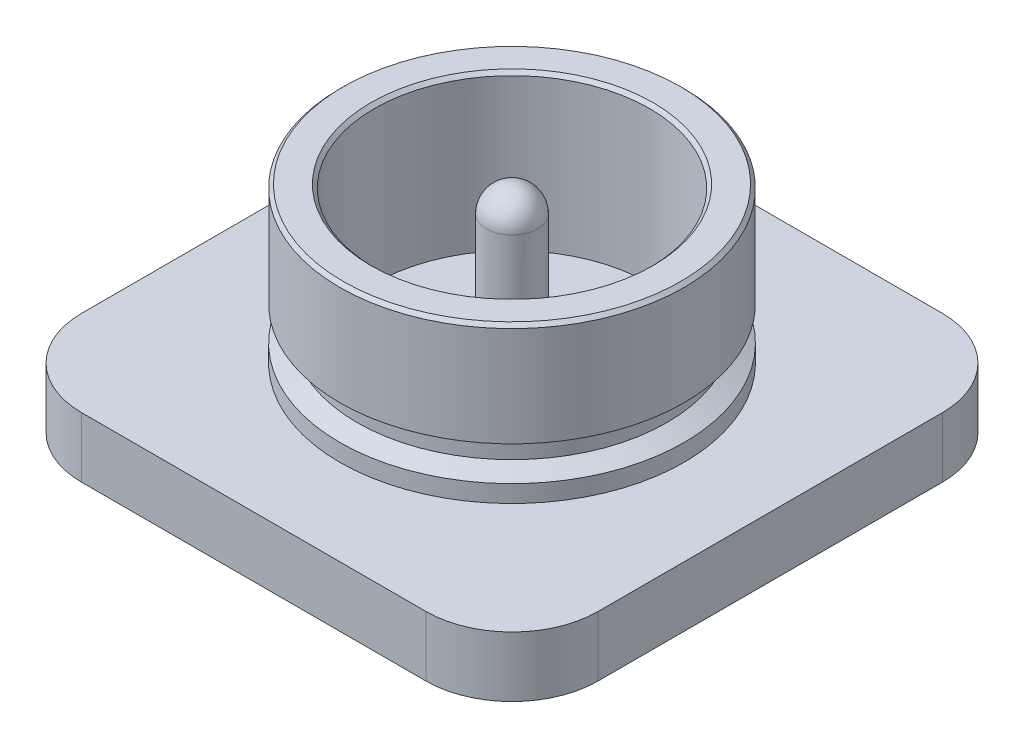
ISO-10303-21;
HEADER;
FILE_DESCRIPTION(('STEP AP214'),'2;1');
FILE_NAME('part.step','',(''),(''),'','','');
FILE_SCHEMA(('AUTOMOTIVE_DESIGN { 1 0 10303 214 1 1 1 1 }'));
ENDSEC;
DATA;
#1=APPLICATION_CONTEXT('core data for automotive mechanical design processes');
#2=APPLICATION_PROTOCOL_DEFINITION('international standard','automotive_design',2000,#1);
#3=PRODUCT_CONTEXT('',#1,'mechanical');
#4=PRODUCT('Part','Part','',(#3));
#5=PRODUCT_RELATED_PRODUCT_CATEGORY('part','',(#4));
#6=PRODUCT_DEFINITION_FORMATION('','',#4);
#7=PRODUCT_DEFINITION_CONTEXT('part definition',#1,'design');
#8=PRODUCT_DEFINITION('design','',#6,#7);
#9=PRODUCT_DEFINITION_SHAPE('','',#8);
#10=(LENGTH_UNIT() NAMED_UNIT(*) SI_UNIT(.MILLI.,.METRE.));
#11=(NAMED_UNIT(*) PLANE_ANGLE_UNIT() SI_UNIT($,.RADIAN.));
#12=(NAMED_UNIT(*) SI_UNIT($,.STERADIAN.) SOLID_ANGLE_UNIT());
#13=UNCERTAINTY_MEASURE_WITH_UNIT(LENGTH_MEASURE(1.E-05),#10,'distance_accuracy_value','');
#14=(GEOMETRIC_REPRESENTATION_CONTEXT(3) GLOBAL_UNCERTAINTY_ASSIGNED_CONTEXT((#13)) GLOBAL_UNIT_ASSIGNED_CONTEXT((#10,
#11,#12)) REPRESENTATION_CONTEXT('',''));
#15=CARTESIAN_POINT('',(0.,0.,0.));
#16=DIRECTION('',(0.,0.,1.));
#17=DIRECTION('',(1.,0.,0.));
#18=AXIS2_PLACEMENT_3D('',#15,#16,#17);
#19=CARTESIAN_POINT('',(-8.95484467631839,4.93275388580445,0.));
#20=DIRECTION('',(1.,0.,0.));
#21=DIRECTION('',(0.,1.,0.));
#22=AXIS2_PLACEMENT_3D('',#19,#20,#21);
#23=SPHERICAL_SURFACE('',#22,0.15);
#24=CARTESIAN_POINT('',(-8.95484467631839,4.93275388580445,0.));
#25=DIRECTION('',(0.,-1.,0.));
#26=DIRECTION('',(0.,0.,-1.));
#27=AXIS2_PLACEMENT_3D('',#24,#25,#26);
#28=CIRCLE('',#27,0.15);
#29=CARTESIAN_POINT('',(-9.10484467631839,4.93275388580445,0.));
#30=VERTEX_POINT('',#29);
#31=CARTESIAN_POINT('',(-8.80484467631839,4.93275388580445,0.));
#32=VERTEX_POINT('',#31);
#33=EDGE_CURVE('E21',#30,#32,#28,.T.);
#34=ORIENTED_EDGE('',*,*,#33,.F.);
#35=CARTESIAN_POINT('',(-8.95484467631839,4.93275388580445,0.));
#36=DIRECTION('',(0.,-1.,0.));
#37=DIRECTION('',(0.,0.,-1.));
#38=AXIS2_PLACEMENT_3D('',#35,#36,#37);
#39=CIRCLE('',#38,0.15);
#40=EDGE_CURVE('E33',#32,#30,#39,.T.);
#41=ORIENTED_EDGE('',*,*,#40,.F.);
#42=EDGE_LOOP('',(#34,#41));
#43=FACE_BOUND('',#42,.T.);
#44=ADVANCED_FACE('F17',(#43),#23,.T.);
#45=CARTESIAN_POINT('',(-8.95484467631839,5.08275388580445,0.));
#46=DIRECTION('',(0.,-1.,0.));
#47=DIRECTION('',(0.,0.,-1.));
#48=AXIS2_PLACEMENT_3D('',#45,#46,#47);
#49=CYLINDRICAL_SURFACE('',#48,0.15);
#50=ORIENTED_EDGE('',*,*,#33,.T.);
#51=ORIENTED_EDGE('',*,*,#40,.T.);
#52=EDGE_LOOP('',(#50,#51));
#53=FACE_BOUND('',#52,.T.);
#54=CARTESIAN_POINT('',(-8.95484467631839,4.18275388580445,0.));
#55=DIRECTION('',(0.,-1.,0.));
#56=DIRECTION('',(0.,0.,-1.));
#57=AXIS2_PLACEMENT_3D('',#54,#55,#56);
#58=CIRCLE('',#57,0.15);
#59=CARTESIAN_POINT('',(-8.95484467631839,4.18275388580445,-0.15));
#60=VERTEX_POINT('',#59);
#61=EDGE_CURVE('E196',#60,#60,#58,.T.);
#62=ORIENTED_EDGE('',*,*,#61,.F.);
#63=EDGE_LOOP('',(#62));
#64=FACE_BOUND('',#63,.T.);
#65=ADVANCED_FACE('F200',(#53,#64),#49,.T.);
#66=CARTESIAN_POINT('',(-9.14234467631839,4.18275388580445,0.1875));
#67=DIRECTION('',(0.,1.,0.));
#68=DIRECTION('',(-1.,0.,0.));
#69=AXIS2_PLACEMENT_3D('',#66,#67,#68);
#70=PLANE('',#69);
#71=CARTESIAN_POINT('',(-8.95484467631839,4.18275388580445,0.));
#72=DIRECTION('',(0.,-1.,0.));
#73=DIRECTION('',(0.,0.,-1.));
#74=AXIS2_PLACEMENT_3D('',#71,#72,#73);
#75=CIRCLE('',#74,0.8);
#76=CARTESIAN_POINT('',(-8.95484467631839,4.18275388580445,-0.8));
#77=VERTEX_POINT('',#76);
#78=EDGE_CURVE('E176',#77,#77,#75,.F.);
#79=ORIENTED_EDGE('',*,*,#78,.T.);
#80=EDGE_LOOP('',(#79));
#81=FACE_BOUND('',#80,.T.);
#82=ORIENTED_EDGE('',*,*,#61,.T.);
#83=EDGE_LOOP('',(#82));
#84=FACE_BOUND('',#83,.T.);
#85=ADVANCED_FACE('F209',(#81,#84),#70,.T.);
#86=CARTESIAN_POINT('',(-8.95484467631839,5.08275388580445,0.));
#87=DIRECTION('',(0.,-1.,0.));
#88=DIRECTION('',(0.,0.,-1.));
#89=AXIS2_PLACEMENT_3D('',#86,#87,#88);
#90=CYLINDRICAL_SURFACE('',#89,0.8);
#91=CARTESIAN_POINT('',(-8.95484467631839,5.06275388579525,0.));
#92=DIRECTION('',(0.,1.,0.));
#93=DIRECTION('',(-1.,0.,0.));
#94=AXIS2_PLACEMENT_3D('',#91,#92,#93);
#95=CIRCLE('',#94,0.79999999993326);
#96=CARTESIAN_POINT('',(-9.75484467625165,5.06275388579525,0.));
#97=VERTEX_POINT('',#96);
#98=EDGE_CURVE('E172',#97,#97,#95,.T.);
#99=ORIENTED_EDGE('',*,*,#98,.T.);
#100=EDGE_LOOP('',(#99));
#101=FACE_BOUND('',#100,.T.);
#102=ORIENTED_EDGE('',*,*,#78,.F.);
#103=EDGE_LOOP('',(#102));
#104=FACE_BOUND('',#103,.T.);
#105=ADVANCED_FACE('F279',(#101,#104),#90,.F.);
#106=CARTESIAN_POINT('',(-8.95484467631839,5.08275388580159,0.));
#107=DIRECTION('',(0.,1.,0.));
#108=DIRECTION('',(0.,0.,1.));
#109=AXIS2_PLACEMENT_3D('',#106,#107,#108);
#110=CONICAL_SURFACE('',#109,0.819999999939609,0.785398163397448);
#111=CARTESIAN_POINT('',(-8.95484467631839,5.08275388585844,0.));
#112=DIRECTION('',(0.,1.,0.));
#113=DIRECTION('',(0.,0.,1.));
#114=AXIS2_PLACEMENT_3D('',#111,#112,#113);
#115=CIRCLE('',#114,0.819999999996452);
#116=CARTESIAN_POINT('',(-8.95484467631839,5.08275388585844,0.819999999996452));
#117=VERTEX_POINT('',#116);
#118=EDGE_CURVE('E175',#117,#117,#115,.F.);
#119=ORIENTED_EDGE('',*,*,#118,.F.);
#120=EDGE_LOOP('',(#119));
#121=FACE_BOUND('',#120,.T.);
#122=ORIENTED_EDGE('',*,*,#98,.F.);
#123=EDGE_LOOP('',(#122));
#124=FACE_BOUND('',#123,.T.);
#125=ADVANCED_FACE('F275',(#121,#124),#110,.F.);
#126=CARTESIAN_POINT('',(-9.45484467631839,5.08275388580445,0.));
#127=DIRECTION('',(0.,1.,0.));
#128=DIRECTION('',(0.,0.,1.));
#129=AXIS2_PLACEMENT_3D('',#126,#127,#128);
#130=PLANE('',#129);
#131=ORIENTED_EDGE('',*,*,#118,.T.);
#132=EDGE_LOOP('',(#131));
#133=FACE_BOUND('',#132,.T.);
#134=CARTESIAN_POINT('',(-8.95484467631839,5.08275388585844,0.));
#135=DIRECTION('',(0.,-1.,0.));
#136=DIRECTION('',(0.,0.,-1.));
#137=AXIS2_PLACEMENT_3D('',#134,#135,#136);
#138=CIRCLE('',#137,0.980000000006458);
#139=CARTESIAN_POINT('',(-8.95484467631839,5.08275388585844,-0.980000000006458));
#140=VERTEX_POINT('',#139);
#141=EDGE_CURVE('E169',#140,#140,#138,.T.);
#142=ORIENTED_EDGE('',*,*,#141,.F.);
#143=EDGE_LOOP('',(#142));
#144=FACE_BOUND('',#143,.T.);
#145=ADVANCED_FACE('F271',(#133,#144),#130,.T.);
#146=CARTESIAN_POINT('',(-8.95484467631839,5.06275388585209,0.));
#147=DIRECTION('',(0.,-1.,0.));
#148=DIRECTION('',(0.,0.,-1.));
#149=AXIS2_PLACEMENT_3D('',#146,#147,#148);
#150=CONICAL_SURFACE('',#149,1.00000000001281,0.785398163397448);
#151=ORIENTED_EDGE('',*,*,#141,.T.);
#152=EDGE_LOOP('',(#151));
#153=FACE_BOUND('',#152,.T.);
#154=CARTESIAN_POINT('',(-8.95484467631839,5.06275388580445,0.));
#155=DIRECTION('',(0.,1.,0.));
#156=DIRECTION('',(0.,0.,1.));
#157=AXIS2_PLACEMENT_3D('',#154,#155,#156);
#158=CIRCLE('',#157,1.);
#159=CARTESIAN_POINT('',(-8.95484467631839,5.06275388580445,1.));
#160=VERTEX_POINT('',#159);
#161=EDGE_CURVE('E164',#160,#160,#158,.F.);
#162=ORIENTED_EDGE('',*,*,#161,.F.);
#163=EDGE_LOOP('',(#162));
#164=FACE_BOUND('',#163,.T.);
#165=ADVANCED_FACE('F267',(#153,#164),#150,.T.);
#166=CARTESIAN_POINT('',(-8.95484467631839,4.78275388580445,0.));
#167=DIRECTION('',(0.,1.,0.));
#168=DIRECTION('',(0.,0.,1.));
#169=AXIS2_PLACEMENT_3D('',#166,#167,#168);
#170=CYLINDRICAL_SURFACE('',#169,1.);
#171=ORIENTED_EDGE('',*,*,#161,.T.);
#172=EDGE_LOOP('',(#171));
#173=FACE_BOUND('',#172,.T.);
#174=CARTESIAN_POINT('',(-8.95484467631839,4.48275388578167,0.));
#175=DIRECTION('',(0.,1.,0.));
#176=DIRECTION('',(-1.,0.,0.));
#177=AXIS2_PLACEMENT_3D('',#174,#175,#176);
#178=CIRCLE('',#177,0.9999999999399);
#179=CARTESIAN_POINT('',(-9.95484467625829,4.48275388578167,0.));
#180=VERTEX_POINT('',#179);
#181=EDGE_CURVE('E159',#180,#180,#178,.F.);
#182=ORIENTED_EDGE('',*,*,#181,.F.);
#183=EDGE_LOOP('',(#182));
#184=FACE_BOUND('',#183,.T.);
#185=ADVANCED_FACE('F263',(#173,#184),#170,.T.);
#186=CARTESIAN_POINT('',(-8.95484467631839,4.48275388572483,0.));
#187=DIRECTION('',(0.,1.,0.));
#188=DIRECTION('',(0.,0.,1.));
#189=AXIS2_PLACEMENT_3D('',#186,#187,#188);
#190=CONICAL_SURFACE('',#189,0.999999999826213,1.10714871779409);
#191=CARTESIAN_POINT('',(-8.95484467631839,4.43275388580445,0.));
#192=DIRECTION('',(0.,1.,0.));
#193=DIRECTION('',(0.,0.,1.));
#194=AXIS2_PLACEMENT_3D('',#191,#192,#193);
#195=CIRCLE('',#194,0.9);
#196=CARTESIAN_POINT('',(-8.95484467631839,4.43275388580445,0.9));
#197=VERTEX_POINT('',#196);
#198=EDGE_CURVE('E154',#197,#197,#195,.F.);
#199=ORIENTED_EDGE('',*,*,#198,.F.);
#200=EDGE_LOOP('',(#199));
#201=FACE_BOUND('',#200,.T.);
#202=ORIENTED_EDGE('',*,*,#181,.T.);
#203=EDGE_LOOP('',(#202));
#204=FACE_BOUND('',#203,.T.);
#205=ADVANCED_FACE('F259',(#201,#204),#190,.T.);
#206=CARTESIAN_POINT('',(-8.95484467631839,4.38275388580445,0.));
#207=DIRECTION('',(0.,1.,0.));
#208=DIRECTION('',(0.,0.,1.));
#209=AXIS2_PLACEMENT_3D('',#206,#207,#208);
#210=CYLINDRICAL_SURFACE('',#209,0.9);
#211=CARTESIAN_POINT('',(-8.95484467631839,4.33275388581933,0.));
#212=DIRECTION('',(0.,-1.,0.));
#213=DIRECTION('',(-1.,0.,0.));
#214=AXIS2_PLACEMENT_3D('',#211,#212,#213);
#215=CIRCLE('',#214,0.900000000021845);
#216=CARTESIAN_POINT('',(-9.85484467634024,4.33275388581933,0.));
#217=VERTEX_POINT('',#216);
#218=EDGE_CURVE('E149',#217,#217,#215,.T.);
#219=ORIENTED_EDGE('',*,*,#218,.F.);
#220=EDGE_LOOP('',(#219));
#221=FACE_BOUND('',#220,.T.);
#222=ORIENTED_EDGE('',*,*,#198,.T.);
#223=EDGE_LOOP('',(#222));
#224=FACE_BOUND('',#223,.T.);
#225=ADVANCED_FACE('F255',(#221,#224),#210,.T.);
#226=CARTESIAN_POINT('',(-8.95484467631839,4.28275388588873,0.));
#227=DIRECTION('',(0.,-1.,0.));
#228=DIRECTION('',(0.,0.,-1.));
#229=AXIS2_PLACEMENT_3D('',#226,#227,#228);
#230=CONICAL_SURFACE('',#229,0.999999999826213,1.10714871779409);
#231=CARTESIAN_POINT('',(-8.95484467631839,4.28275388580445,0.));
#232=DIRECTION('',(0.,1.,0.));
#233=DIRECTION('',(0.,0.,1.));
#234=AXIS2_PLACEMENT_3D('',#231,#232,#233);
#235=CIRCLE('',#234,1.);
#236=CARTESIAN_POINT('',(-8.95484467631839,4.28275388580445,1.));
#237=VERTEX_POINT('',#236);
#238=EDGE_CURVE('E145',#237,#237,#235,.F.);
#239=ORIENTED_EDGE('',*,*,#238,.F.);
#240=EDGE_LOOP('',(#239));
#241=FACE_BOUND('',#240,.T.);
#242=ORIENTED_EDGE('',*,*,#218,.T.);
#243=EDGE_LOOP('',(#242));
#244=FACE_BOUND('',#243,.T.);
#245=ADVANCED_FACE('F251',(#241,#244),#230,.T.);
#246=CARTESIAN_POINT('',(-8.95484467631839,4.23275388580445,0.));
#247=DIRECTION('',(0.,1.,0.));
#248=DIRECTION('',(0.,0.,1.));
#249=AXIS2_PLACEMENT_3D('',#246,#247,#248);
#250=CYLINDRICAL_SURFACE('',#249,1.);
#251=CARTESIAN_POINT('',(-8.95484467631839,4.18275388580445,0.));
#252=DIRECTION('',(0.,1.,0.));
#253=DIRECTION('',(0.,0.,1.));
#254=AXIS2_PLACEMENT_3D('',#251,#252,#253);
#255=CIRCLE('',#254,1.);
#256=CARTESIAN_POINT('',(-8.95484467631839,4.18275388580445,1.));
#257=VERTEX_POINT('',#256);
#258=EDGE_CURVE('E148',#257,#257,#255,.F.);
#259=ORIENTED_EDGE('',*,*,#258,.F.);
#260=EDGE_LOOP('',(#259));
#261=FACE_BOUND('',#260,.T.);
#262=ORIENTED_EDGE('',*,*,#238,.T.);
#263=EDGE_LOOP('',(#262));
#264=FACE_BOUND('',#263,.T.);
#265=ADVANCED_FACE('F247',(#261,#264),#250,.T.);
#266=CARTESIAN_POINT('',(-9.14234467631839,4.18275388580445,0.1875));
#267=DIRECTION('',(0.,1.,0.));
#268=DIRECTION('',(-1.,0.,0.));
#269=AXIS2_PLACEMENT_3D('',#266,#267,#268);
#270=PLANE('',#269);
#271=CARTESIAN_POINT('',(-7.95484467631839,4.18275388580445,-1.));
#272=DIRECTION('',(0.,-1.,0.));
#273=DIRECTION('',(0.,0.,-1.));
#274=AXIS2_PLACEMENT_3D('',#271,#272,#273);
#275=CIRCLE('',#274,0.5);
#276=CARTESIAN_POINT('',(-7.95484467631839,4.18275388580445,-1.5));
#277=VERTEX_POINT('',#276);
#278=CARTESIAN_POINT('',(-7.45484467631839,4.18275388580445,-1.));
#279=VERTEX_POINT('',#278);
#280=EDGE_CURVE('E125',#277,#279,#275,.T.);
#281=ORIENTED_EDGE('',*,*,#280,.F.);
#282=DIRECTION('',(-1.,0.,0.));
#283=VECTOR('',#282,1.);
#284=CARTESIAN_POINT('',(-8.95484467631839,4.18275388580445,-1.5));
#285=LINE('',#284,#283);
#286=CARTESIAN_POINT('',(-9.95484467631839,4.18275388580445,-1.5));
#287=VERTEX_POINT('',#286);
#288=EDGE_CURVE('E122',#287,#277,#285,.F.);
#289=ORIENTED_EDGE('',*,*,#288,.F.);
#290=CARTESIAN_POINT('',(-9.95484467631839,4.18275388580445,-1.));
#291=DIRECTION('',(0.,-1.,0.));
#292=DIRECTION('',(0.,0.,-1.));
#293=AXIS2_PLACEMENT_3D('',#290,#291,#292);
#294=CIRCLE('',#293,0.5);
#295=CARTESIAN_POINT('',(-10.4548446763184,4.18275388580445,-1.));
#296=VERTEX_POINT('',#295);
#297=EDGE_CURVE('E89',#287,#296,#294,.F.);
#298=ORIENTED_EDGE('',*,*,#297,.T.);
#299=DIRECTION('',(0.,0.,1.));
#300=VECTOR('',#299,1.);
#301=CARTESIAN_POINT('',(-10.4548446763184,4.18275388580445,-1.5));
#302=LINE('',#301,#300);
#303=CARTESIAN_POINT('',(-10.4548446763184,4.18275388580445,1.));
#304=VERTEX_POINT('',#303);
#305=EDGE_CURVE('E139',#304,#296,#302,.F.);
#306=ORIENTED_EDGE('',*,*,#305,.F.);
#307=CARTESIAN_POINT('',(-9.95484467631839,4.18275388580445,1.));
#308=DIRECTION('',(0.,-1.,0.));
#309=DIRECTION('',(0.,0.,-1.));
#310=AXIS2_PLACEMENT_3D('',#307,#308,#309);
#311=CIRCLE('',#310,0.5);
#312=CARTESIAN_POINT('',(-9.95484467631839,4.18275388580445,1.5));
#313=VERTEX_POINT('',#312);
#314=EDGE_CURVE('E137',#313,#304,#311,.T.);
#315=ORIENTED_EDGE('',*,*,#314,.F.);
#316=DIRECTION('',(1.,0.,0.));
#317=VECTOR('',#316,1.);
#318=CARTESIAN_POINT('',(-10.4548446763184,4.18275388580445,1.5));
#319=LINE('',#318,#317);
#320=CARTESIAN_POINT('',(-7.95484467631839,4.18275388580445,1.5));
#321=VERTEX_POINT('',#320);
#322=EDGE_CURVE('E134',#321,#313,#319,.F.);
#323=ORIENTED_EDGE('',*,*,#322,.F.);
#324=CARTESIAN_POINT('',(-7.95484467631839,4.18275388580445,1.));
#325=DIRECTION('',(0.,-1.,0.));
#326=DIRECTION('',(0.,0.,-1.));
#327=AXIS2_PLACEMENT_3D('',#324,#325,#326);
#328=CIRCLE('',#327,0.5);
#329=CARTESIAN_POINT('',(-7.45484467631839,4.18275388580445,1.));
#330=VERTEX_POINT('',#329);
#331=EDGE_CURVE('E131',#330,#321,#328,.T.);
#332=ORIENTED_EDGE('',*,*,#331,.F.);
#333=DIRECTION('',(0.,0.,-1.));
#334=VECTOR('',#333,1.);
#335=CARTESIAN_POINT('',(-7.45484467631839,4.18275388580445,0.));
#336=LINE('',#335,#334);
#337=EDGE_CURVE('E128',#279,#330,#336,.F.);
#338=ORIENTED_EDGE('',*,*,#337,.F.);
#339=EDGE_LOOP('',(#281,#289,#298,#306,#315,#323,#332,#338));
#340=FACE_BOUND('',#339,.T.);
#341=ORIENTED_EDGE('',*,*,#258,.T.);
#342=EDGE_LOOP('',(#341));
#343=FACE_BOUND('',#342,.T.);
#344=ADVANCED_FACE('F243',(#340,#343),#270,.T.);
#345=CARTESIAN_POINT('',(-10.4548446763184,4.18275388580445,-1.5));
#346=DIRECTION('',(-1.,0.,0.));
#347=DIRECTION('',(0.,0.,1.));
#348=AXIS2_PLACEMENT_3D('',#345,#346,#347);
#349=PLANE('',#348);
#350=DIRECTION('',(0.,-1.,0.));
#351=VECTOR('',#350,1.);
#352=CARTESIAN_POINT('',(-10.4548446763184,4.18275388580445,1.));
#353=LINE('',#352,#351);
#354=CARTESIAN_POINT('',(-10.4548446763184,3.83275388580445,1.));
#355=VERTEX_POINT('',#354);
#356=EDGE_CURVE('E135',#304,#355,#353,.T.);
#357=ORIENTED_EDGE('',*,*,#356,.F.);
#358=ORIENTED_EDGE('',*,*,#305,.T.);
#359=DIRECTION('',(0.,-1.,0.));
#360=VECTOR('',#359,1.);
#361=CARTESIAN_POINT('',(-10.4548446763184,4.18275388580445,-1.));
#362=LINE('',#361,#360);
#363=CARTESIAN_POINT('',(-10.4548446763184,3.83275388580445,-1.));
#364=VERTEX_POINT('',#363);
#365=EDGE_CURVE('E94',#364,#296,#362,.F.);
#366=ORIENTED_EDGE('',*,*,#365,.F.);
#367=DIRECTION('',(0.,0.,1.));
#368=VECTOR('',#367,1.);
#369=CARTESIAN_POINT('',(-10.4548446763184,3.83275388580445,0.1875));
#370=LINE('',#369,#368);
#371=EDGE_CURVE('E93',#364,#355,#370,.T.);
#372=ORIENTED_EDGE('',*,*,#371,.T.);
#373=EDGE_LOOP('',(#357,#358,#366,#372));
#374=FACE_BOUND('',#373,.T.);
#375=ADVANCED_FACE('F239',(#374),#349,.T.);
#376=CARTESIAN_POINT('',(-9.95484467631839,4.18275388580445,1.));
#377=DIRECTION('',(0.,-1.,0.));
#378=DIRECTION('',(0.,0.,-1.));
#379=AXIS2_PLACEMENT_3D('',#376,#377,#378);
#380=CYLINDRICAL_SURFACE('',#379,0.5);
#381=ORIENTED_EDGE('',*,*,#314,.T.);
#382=ORIENTED_EDGE('',*,*,#356,.T.);
#383=CARTESIAN_POINT('',(-9.95484467631839,3.83275388580445,1.));
#384=DIRECTION('',(0.,-1.,0.));
#385=DIRECTION('',(0.,0.,-1.));
#386=AXIS2_PLACEMENT_3D('',#383,#384,#385);
#387=CIRCLE('',#386,0.5);
#388=CARTESIAN_POINT('',(-9.95484467631839,3.83275388580445,1.5));
#389=VERTEX_POINT('',#388);
#390=EDGE_CURVE('E118',#355,#389,#387,.F.);
#391=ORIENTED_EDGE('',*,*,#390,.T.);
#392=DIRECTION('',(0.,1.,0.));
#393=VECTOR('',#392,1.);
#394=CARTESIAN_POINT('',(-9.95484467631839,4.18275388580445,1.5));
#395=LINE('',#394,#393);
#396=EDGE_CURVE('E132',#313,#389,#395,.F.);
#397=ORIENTED_EDGE('',*,*,#396,.F.);
#398=EDGE_LOOP('',(#381,#382,#391,#397));
#399=FACE_BOUND('',#398,.T.);
#400=ADVANCED_FACE('F235',(#399),#380,.T.);
#401=CARTESIAN_POINT('',(-10.4548446763184,4.18275388580445,1.5));
#402=DIRECTION('',(0.,0.,1.));
#403=DIRECTION('',(1.,0.,0.));
#404=AXIS2_PLACEMENT_3D('',#401,#402,#403);
#405=PLANE('',#404);
#406=DIRECTION('',(0.,-1.,0.));
#407=VECTOR('',#406,1.);
#408=CARTESIAN_POINT('',(-7.95484467631839,4.18275388580445,1.5));
#409=LINE('',#408,#407);
#410=CARTESIAN_POINT('',(-7.95484467631839,3.83275388580445,1.5));
#411=VERTEX_POINT('',#410);
#412=EDGE_CURVE('E129',#321,#411,#409,.T.);
#413=ORIENTED_EDGE('',*,*,#412,.F.);
#414=ORIENTED_EDGE('',*,*,#322,.T.);
#415=ORIENTED_EDGE('',*,*,#396,.T.);
#416=DIRECTION('',(-1.,0.,0.));
#417=VECTOR('',#416,1.);
#418=CARTESIAN_POINT('',(-9.14234467631839,3.83275388580445,1.5));
#419=LINE('',#418,#417);
#420=EDGE_CURVE('E115',#389,#411,#419,.F.);
#421=ORIENTED_EDGE('',*,*,#420,.T.);
#422=EDGE_LOOP('',(#413,#414,#415,#421));
#423=FACE_BOUND('',#422,.T.);
#424=ADVANCED_FACE('F231',(#423),#405,.T.);
#425=CARTESIAN_POINT('',(-7.95484467631839,4.18275388580445,1.));
#426=DIRECTION('',(0.,-1.,0.));
#427=DIRECTION('',(0.,0.,-1.));
#428=AXIS2_PLACEMENT_3D('',#425,#426,#427);
#429=CYLINDRICAL_SURFACE('',#428,0.5);
#430=ORIENTED_EDGE('',*,*,#331,.T.);
#431=ORIENTED_EDGE('',*,*,#412,.T.);
#432=CARTESIAN_POINT('',(-7.95484467631839,3.83275388580445,1.));
#433=DIRECTION('',(0.,-1.,0.));
#434=DIRECTION('',(0.,0.,-1.));
#435=AXIS2_PLACEMENT_3D('',#432,#433,#434);
#436=CIRCLE('',#435,0.5);
#437=CARTESIAN_POINT('',(-7.45484467631839,3.83275388580445,1.));
#438=VERTEX_POINT('',#437);
#439=EDGE_CURVE('E114',#411,#438,#436,.F.);
#440=ORIENTED_EDGE('',*,*,#439,.T.);
#441=DIRECTION('',(0.,1.,0.));
#442=VECTOR('',#441,1.);
#443=CARTESIAN_POINT('',(-7.45484467631839,4.18275388580445,1.));
#444=LINE('',#443,#442);
#445=EDGE_CURVE('E126',#330,#438,#444,.F.);
#446=ORIENTED_EDGE('',*,*,#445,.F.);
#447=EDGE_LOOP('',(#430,#431,#440,#446));
#448=FACE_BOUND('',#447,.T.);
#449=ADVANCED_FACE('F227',(#448),#429,.T.);
#450=CARTESIAN_POINT('',(-7.45484467631839,4.18275388580445,0.));
#451=DIRECTION('',(1.,0.,0.));
#452=DIRECTION('',(0.,0.,-1.));
#453=AXIS2_PLACEMENT_3D('',#450,#451,#452);
#454=PLANE('',#453);
#455=ORIENTED_EDGE('',*,*,#445,.T.);
#456=DIRECTION('',(0.,0.,1.));
#457=VECTOR('',#456,1.);
#458=CARTESIAN_POINT('',(-7.45484467631839,3.83275388580445,0.1875));
#459=LINE('',#458,#457);
#460=CARTESIAN_POINT('',(-7.45484467631839,3.83275388580445,-1.));
#461=VERTEX_POINT('',#460);
#462=EDGE_CURVE('E109',#438,#461,#459,.F.);
#463=ORIENTED_EDGE('',*,*,#462,.T.);
#464=DIRECTION('',(0.,-1.,0.));
#465=VECTOR('',#464,1.);
#466=CARTESIAN_POINT('',(-7.45484467631839,4.18275388580445,-1.));
#467=LINE('',#466,#465);
#468=EDGE_CURVE('E123',#279,#461,#467,.T.);
#469=ORIENTED_EDGE('',*,*,#468,.F.);
#470=ORIENTED_EDGE('',*,*,#337,.T.);
#471=EDGE_LOOP('',(#455,#463,#469,#470));
#472=FACE_BOUND('',#471,.T.);
#473=ADVANCED_FACE('F223',(#472),#454,.T.);
#474=CARTESIAN_POINT('',(-7.95484467631839,4.18275388580445,-1.));
#475=DIRECTION('',(0.,-1.,0.));
#476=DIRECTION('',(0.,0.,-1.));
#477=AXIS2_PLACEMENT_3D('',#474,#475,#476);
#478=CYLINDRICAL_SURFACE('',#477,0.5);
#479=ORIENTED_EDGE('',*,*,#280,.T.);
#480=ORIENTED_EDGE('',*,*,#468,.T.);
#481=CARTESIAN_POINT('',(-7.95484467631839,3.83275388580445,-1.));
#482=DIRECTION('',(0.,-1.,0.));
#483=DIRECTION('',(0.,0.,-1.));
#484=AXIS2_PLACEMENT_3D('',#481,#482,#483);
#485=CIRCLE('',#484,0.5);
#486=CARTESIAN_POINT('',(-7.95484467631839,3.83275388580445,-1.5));
#487=VERTEX_POINT('',#486);
#488=EDGE_CURVE('E107',#461,#487,#485,.F.);
#489=ORIENTED_EDGE('',*,*,#488,.T.);
#490=DIRECTION('',(0.,1.,0.));
#491=VECTOR('',#490,1.);
#492=CARTESIAN_POINT('',(-7.95484467631839,4.18275388580445,-1.5));
#493=LINE('',#492,#491);
#494=EDGE_CURVE('E106',#277,#487,#493,.F.);
#495=ORIENTED_EDGE('',*,*,#494,.F.);
#496=EDGE_LOOP('',(#479,#480,#489,#495));
#497=FACE_BOUND('',#496,.T.);
#498=ADVANCED_FACE('F220',(#497),#478,.T.);
#499=CARTESIAN_POINT('',(-8.95484467631839,4.18275388580445,-1.5));
#500=DIRECTION('',(0.,0.,-1.));
#501=DIRECTION('',(-1.,0.,0.));
#502=AXIS2_PLACEMENT_3D('',#499,#500,#501);
#503=PLANE('',#502);
#504=ORIENTED_EDGE('',*,*,#494,.T.);
#505=DIRECTION('',(-1.,0.,0.));
#506=VECTOR('',#505,1.);
#507=CARTESIAN_POINT('',(-9.14234467631839,3.83275388580445,-1.5));
#508=LINE('',#507,#506);
#509=CARTESIAN_POINT('',(-9.95484467631839,3.83275388580445,-1.5));
#510=VERTEX_POINT('',#509);
#511=EDGE_CURVE('E27',#487,#510,#508,.T.);
#512=ORIENTED_EDGE('',*,*,#511,.T.);
#513=DIRECTION('',(0.,-1.,0.));
#514=VECTOR('',#513,1.);
#515=CARTESIAN_POINT('',(-9.95484467631839,4.18275388580445,-1.5));
#516=LINE('',#515,#514);
#517=EDGE_CURVE('E85',#287,#510,#516,.T.);
#518=ORIENTED_EDGE('',*,*,#517,.F.);
#519=ORIENTED_EDGE('',*,*,#288,.T.);
#520=EDGE_LOOP('',(#504,#512,#518,#519));
#521=FACE_BOUND('',#520,.T.);
#522=ADVANCED_FACE('F104',(#521),#503,.T.);
#523=CARTESIAN_POINT('',(-9.95484467631839,4.18275388580445,-1.));
#524=DIRECTION('',(0.,-1.,0.));
#525=DIRECTION('',(0.,0.,-1.));
#526=AXIS2_PLACEMENT_3D('',#523,#524,#525);
#527=CYLINDRICAL_SURFACE('',#526,0.5);
#528=ORIENTED_EDGE('',*,*,#297,.F.);
#529=ORIENTED_EDGE('',*,*,#517,.T.);
#530=CARTESIAN_POINT('',(-9.95484467631839,3.83275388580445,-1.));
#531=DIRECTION('',(0.,-1.,0.));
#532=DIRECTION('',(0.,0.,-1.));
#533=AXIS2_PLACEMENT_3D('',#530,#531,#532);
#534=CIRCLE('',#533,0.5);
#535=EDGE_CURVE('E11',#510,#364,#534,.F.);
#536=ORIENTED_EDGE('',*,*,#535,.T.);
#537=ORIENTED_EDGE('',*,*,#365,.T.);
#538=EDGE_LOOP('',(#528,#529,#536,#537));
#539=FACE_BOUND('',#538,.T.);
#540=ADVANCED_FACE('F87',(#539),#527,.T.);
#541=CARTESIAN_POINT('',(-9.14234467631839,3.83275388580445,0.1875));
#542=DIRECTION('',(0.,1.,0.));
#543=DIRECTION('',(-1.,0.,0.));
#544=AXIS2_PLACEMENT_3D('',#541,#542,#543);
#545=PLANE('',#544);
#546=ORIENTED_EDGE('',*,*,#511,.F.);
#547=ORIENTED_EDGE('',*,*,#488,.F.);
#548=ORIENTED_EDGE('',*,*,#462,.F.);
#549=ORIENTED_EDGE('',*,*,#439,.F.);
#550=ORIENTED_EDGE('',*,*,#420,.F.);
#551=ORIENTED_EDGE('',*,*,#390,.F.);
#552=ORIENTED_EDGE('',*,*,#371,.F.);
#553=ORIENTED_EDGE('',*,*,#535,.F.);
#554=EDGE_LOOP('',(#546,#547,#548,#549,#550,#551,#552,#553));
#555=FACE_BOUND('',#554,.T.);
#556=ADVANCED_FACE('F98',(#555),#545,.F.);
#557=CLOSED_SHELL('',(#44,#65,#85,#105,#125,#145,#165,#185,#205,#225,#245,#265,#344,#375,#400,
#424,#449,#473,#498,#522,#540,#556));
#558=MANIFOLD_SOLID_BREP('B1',#557);
#559=ADVANCED_BREP_SHAPE_REPRESENTATION('',(#18,#558),#14);
#560=SHAPE_DEFINITION_REPRESENTATION(#9,#559);
ENDSEC;
END-ISO-10303-21;
